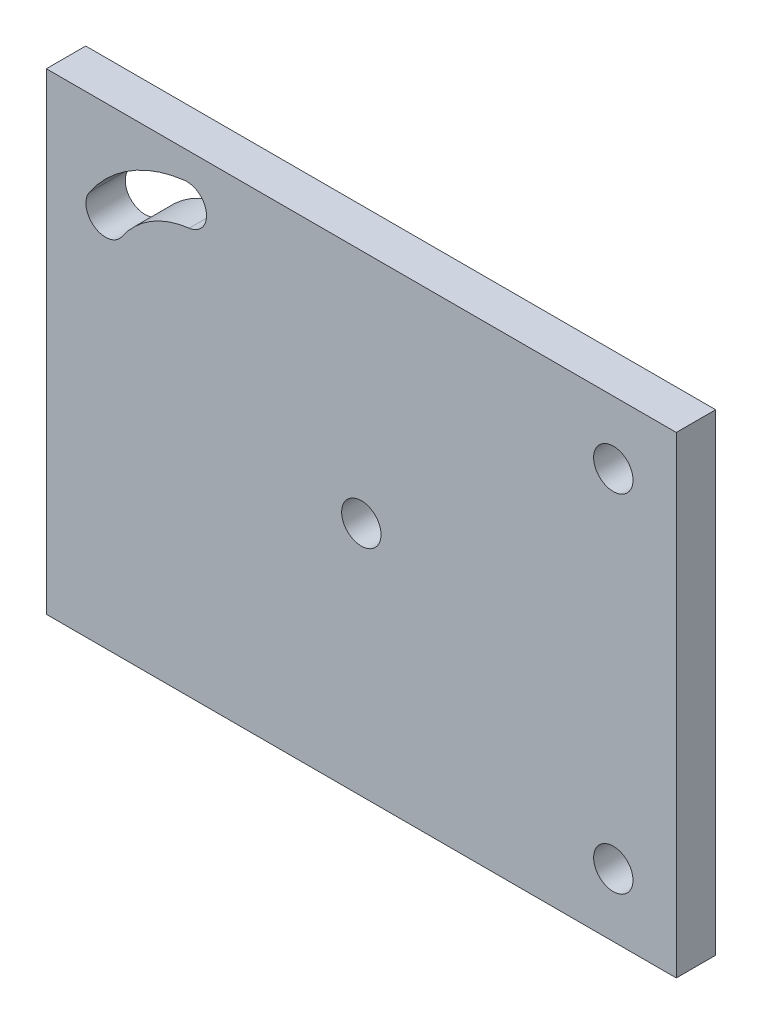
ISO-10303-21;
HEADER;
FILE_DESCRIPTION(('STEP AP214'),'2;1');
FILE_NAME('part.step','',(''),(''),'','','');
FILE_SCHEMA(('AUTOMOTIVE_DESIGN { 1 0 10303 214 1 1 1 1 }'));
ENDSEC;
DATA;
#1=APPLICATION_CONTEXT('core data for automotive mechanical design processes');
#2=APPLICATION_PROTOCOL_DEFINITION('international standard','automotive_design',2000,#1);
#3=PRODUCT_CONTEXT('',#1,'mechanical');
#4=PRODUCT('Part','Part','',(#3));
#5=PRODUCT_RELATED_PRODUCT_CATEGORY('part','',(#4));
#6=PRODUCT_DEFINITION_FORMATION('','',#4);
#7=PRODUCT_DEFINITION_CONTEXT('part definition',#1,'design');
#8=PRODUCT_DEFINITION('design','',#6,#7);
#9=PRODUCT_DEFINITION_SHAPE('','',#8);
#10=(LENGTH_UNIT() NAMED_UNIT(*) SI_UNIT(.MILLI.,.METRE.));
#11=(NAMED_UNIT(*) PLANE_ANGLE_UNIT() SI_UNIT($,.RADIAN.));
#12=(NAMED_UNIT(*) SI_UNIT($,.STERADIAN.) SOLID_ANGLE_UNIT());
#13=UNCERTAINTY_MEASURE_WITH_UNIT(LENGTH_MEASURE(1.E-05),#10,'distance_accuracy_value','');
#14=(GEOMETRIC_REPRESENTATION_CONTEXT(3) GLOBAL_UNCERTAINTY_ASSIGNED_CONTEXT((#13)) GLOBAL_UNIT_ASSIGNED_CONTEXT((#10,
#11,#12)) REPRESENTATION_CONTEXT('',''));
#15=CARTESIAN_POINT('',(0.,0.,0.));
#16=DIRECTION('',(0.,0.,1.));
#17=DIRECTION('',(1.,0.,0.));
#18=AXIS2_PLACEMENT_3D('',#15,#16,#17);
#19=CARTESIAN_POINT('',(0.,0.,5.));
#20=DIRECTION('',(0.,0.,1.));
#21=DIRECTION('',(1.,0.,0.));
#22=AXIS2_PLACEMENT_3D('',#19,#20,#21);
#23=PLANE('',#22);
#24=CARTESIAN_POINT('',(72.,-52.,5.));
#25=DIRECTION('',(0.,0.,1.));
#26=DIRECTION('',(1.,0.,0.));
#27=AXIS2_PLACEMENT_3D('',#24,#25,#26);
#28=CIRCLE('',#27,2.5);
#29=CARTESIAN_POINT('',(74.5,-52.,5.));
#30=VERTEX_POINT('',#29);
#31=EDGE_CURVE('E244',#30,#30,#28,.T.);
#32=ORIENTED_EDGE('',*,*,#31,.F.);
#33=EDGE_LOOP('',(#32));
#34=FACE_BOUND('',#33,.T.);
#35=CARTESIAN_POINT('',(72.,-8.,5.));
#36=DIRECTION('',(0.,0.,1.));
#37=DIRECTION('',(1.,0.,0.));
#38=AXIS2_PLACEMENT_3D('',#35,#36,#37);
#39=CIRCLE('',#38,2.5);
#40=CARTESIAN_POINT('',(74.5,-8.,5.));
#41=VERTEX_POINT('',#40);
#42=EDGE_CURVE('E122',#41,#41,#39,.T.);
#43=ORIENTED_EDGE('',*,*,#42,.F.);
#44=EDGE_LOOP('',(#43));
#45=FACE_BOUND('',#44,.T.);
#46=CARTESIAN_POINT('',(17.8456324907193,-5.9827922517119,5.));
#47=DIRECTION('',(0.,0.,1.));
#48=DIRECTION('',(1.,0.,0.));
#49=AXIS2_PLACEMENT_3D('',#46,#47,#48);
#50=CIRCLE('',#49,2.5);
#51=CARTESIAN_POINT('',(18.1384509239494,-8.4655845034238,5.));
#52=VERTEX_POINT('',#51);
#53=CARTESIAN_POINT('',(17.5528140574892,-3.5,5.));
#54=VERTEX_POINT('',#53);
#55=EDGE_CURVE('E48',#52,#54,#50,.T.);
#56=ORIENTED_EDGE('',*,*,#55,.F.);
#57=CARTESIAN_POINT('',(19.5439794034541,-20.3829873116409,5.));
#58=DIRECTION('',(0.,0.,-1.));
#59=DIRECTION('',(1.,0.,0.));
#60=AXIS2_PLACEMENT_3D('',#57,#58,#59);
#61=CIRCLE('',#60,12.);
#62=CARTESIAN_POINT('',(9.59845967454192,-13.6683289195991,5.));
#63=VERTEX_POINT('',#62);
#64=EDGE_CURVE('E116',#63,#52,#61,.T.);
#65=ORIENTED_EDGE('',*,*,#64,.F.);
#66=CARTESIAN_POINT('',(7.52647639768521,-12.2694417545903,5.));
#67=DIRECTION('',(0.,0.,1.));
#68=DIRECTION('',(1.,0.,0.));
#69=AXIS2_PLACEMENT_3D('',#66,#67,#68);
#70=CIRCLE('',#69,2.5);
#71=CARTESIAN_POINT('',(5.45449312082851,-10.8705545895816,5.));
#72=VERTEX_POINT('',#71);
#73=EDGE_CURVE('E119',#72,#63,#70,.T.);
#74=ORIENTED_EDGE('',*,*,#73,.F.);
#75=CARTESIAN_POINT('',(19.5439794034541,-20.3829873116409,5.));
#76=DIRECTION('',(0.,0.,1.));
#77=DIRECTION('',(1.,0.,0.));
#78=AXIS2_PLACEMENT_3D('',#75,#76,#77);
#79=CIRCLE('',#78,17.);
#80=EDGE_CURVE('E128',#54,#72,#79,.T.);
#81=ORIENTED_EDGE('',*,*,#80,.F.);
#82=EDGE_LOOP('',(#56,#65,#74,#81));
#83=FACE_BOUND('',#82,.T.);
#84=DIRECTION('',(0.,-1.,0.));
#85=VECTOR('',#84,1.);
#86=CARTESIAN_POINT('',(0.,0.,5.));
#87=LINE('',#86,#85);
#88=CARTESIAN_POINT('',(0.,0.,5.));
#89=VERTEX_POINT('',#88);
#90=CARTESIAN_POINT('',(0.,-60.,5.));
#91=VERTEX_POINT('',#90);
#92=EDGE_CURVE('E145',#89,#91,#87,.T.);
#93=ORIENTED_EDGE('',*,*,#92,.T.);
#94=DIRECTION('',(1.,0.,0.));
#95=VECTOR('',#94,1.);
#96=CARTESIAN_POINT('',(0.,-60.,5.));
#97=LINE('',#96,#95);
#98=CARTESIAN_POINT('',(80.,-60.,5.));
#99=VERTEX_POINT('',#98);
#100=EDGE_CURVE('E148',#91,#99,#97,.T.);
#101=ORIENTED_EDGE('',*,*,#100,.T.);
#102=DIRECTION('',(0.,1.,0.));
#103=VECTOR('',#102,1.);
#104=CARTESIAN_POINT('',(80.,0.,5.));
#105=LINE('',#104,#103);
#106=CARTESIAN_POINT('',(80.,0.,5.));
#107=VERTEX_POINT('',#106);
#108=EDGE_CURVE('E151',#99,#107,#105,.T.);
#109=ORIENTED_EDGE('',*,*,#108,.T.);
#110=DIRECTION('',(-1.,0.,0.));
#111=VECTOR('',#110,1.);
#112=CARTESIAN_POINT('',(0.,0.,5.));
#113=LINE('',#112,#111);
#114=EDGE_CURVE('E153',#107,#89,#113,.T.);
#115=ORIENTED_EDGE('',*,*,#114,.T.);
#116=EDGE_LOOP('',(#93,#101,#109,#115));
#117=FACE_BOUND('',#116,.T.);
#118=CARTESIAN_POINT('',(40.,-30.,5.));
#119=DIRECTION('',(0.,0.,1.));
#120=DIRECTION('',(1.,0.,0.));
#121=AXIS2_PLACEMENT_3D('',#118,#119,#120);
#122=CIRCLE('',#121,2.5);
#123=CARTESIAN_POINT('',(42.5,-30.,5.));
#124=VERTEX_POINT('',#123);
#125=EDGE_CURVE('E137',#124,#124,#122,.T.);
#126=ORIENTED_EDGE('',*,*,#125,.F.);
#127=EDGE_LOOP('',(#126));
#128=FACE_BOUND('',#127,.T.);
#129=ADVANCED_FACE('F33',(#34,#45,#83,#117,#128),#23,.T.);
#130=CARTESIAN_POINT('',(0.,0.,0.));
#131=DIRECTION('',(0.,0.,1.));
#132=DIRECTION('',(1.,0.,0.));
#133=AXIS2_PLACEMENT_3D('',#130,#131,#132);
#134=PLANE('',#133);
#135=CARTESIAN_POINT('',(72.,-52.,0.));
#136=DIRECTION('',(0.,0.,1.));
#137=DIRECTION('',(1.,0.,0.));
#138=AXIS2_PLACEMENT_3D('',#135,#136,#137);
#139=CIRCLE('',#138,2.5);
#140=CARTESIAN_POINT('',(74.5,-52.,0.));
#141=VERTEX_POINT('',#140);
#142=EDGE_CURVE('E144',#141,#141,#139,.T.);
#143=ORIENTED_EDGE('',*,*,#142,.T.);
#144=EDGE_LOOP('',(#143));
#145=FACE_BOUND('',#144,.T.);
#146=CARTESIAN_POINT('',(72.,-8.,0.));
#147=DIRECTION('',(0.,0.,1.));
#148=DIRECTION('',(1.,0.,0.));
#149=AXIS2_PLACEMENT_3D('',#146,#147,#148);
#150=CIRCLE('',#149,2.5);
#151=CARTESIAN_POINT('',(74.5,-8.,0.));
#152=VERTEX_POINT('',#151);
#153=EDGE_CURVE('E245',#152,#152,#150,.T.);
#154=ORIENTED_EDGE('',*,*,#153,.T.);
#155=EDGE_LOOP('',(#154));
#156=FACE_BOUND('',#155,.T.);
#157=CARTESIAN_POINT('',(19.5439794034541,-20.3829873116409,0.));
#158=DIRECTION('',(0.,0.,-1.));
#159=DIRECTION('',(1.,0.,0.));
#160=AXIS2_PLACEMENT_3D('',#157,#158,#159);
#161=CIRCLE('',#160,12.);
#162=CARTESIAN_POINT('',(9.59845967454192,-13.6683289195991,0.));
#163=VERTEX_POINT('',#162);
#164=CARTESIAN_POINT('',(18.1384509239494,-8.4655845034238,0.));
#165=VERTEX_POINT('',#164);
#166=EDGE_CURVE('E106',#163,#165,#161,.T.);
#167=ORIENTED_EDGE('',*,*,#166,.T.);
#168=CARTESIAN_POINT('',(17.8456324907193,-5.9827922517119,0.));
#169=DIRECTION('',(0.,0.,1.));
#170=DIRECTION('',(1.,0.,0.));
#171=AXIS2_PLACEMENT_3D('',#168,#169,#170);
#172=CIRCLE('',#171,2.5);
#173=CARTESIAN_POINT('',(17.5528140574892,-3.5,0.));
#174=VERTEX_POINT('',#173);
#175=EDGE_CURVE('E100',#165,#174,#172,.T.);
#176=ORIENTED_EDGE('',*,*,#175,.T.);
#177=CARTESIAN_POINT('',(19.5439794034541,-20.3829873116409,0.));
#178=DIRECTION('',(0.,0.,1.));
#179=DIRECTION('',(1.,0.,0.));
#180=AXIS2_PLACEMENT_3D('',#177,#178,#179);
#181=CIRCLE('',#180,17.);
#182=CARTESIAN_POINT('',(5.45449312082851,-10.8705545895816,0.));
#183=VERTEX_POINT('',#182);
#184=EDGE_CURVE('E109',#174,#183,#181,.T.);
#185=ORIENTED_EDGE('',*,*,#184,.T.);
#186=CARTESIAN_POINT('',(7.52647639768521,-12.2694417545903,0.));
#187=DIRECTION('',(0.,0.,1.));
#188=DIRECTION('',(1.,0.,0.));
#189=AXIS2_PLACEMENT_3D('',#186,#187,#188);
#190=CIRCLE('',#189,2.5);
#191=EDGE_CURVE('E56',#183,#163,#190,.T.);
#192=ORIENTED_EDGE('',*,*,#191,.T.);
#193=EDGE_LOOP('',(#167,#176,#185,#192));
#194=FACE_BOUND('',#193,.T.);
#195=DIRECTION('',(0.,-1.,0.));
#196=VECTOR('',#195,1.);
#197=CARTESIAN_POINT('',(0.,0.,0.));
#198=LINE('',#197,#196);
#199=CARTESIAN_POINT('',(0.,0.,0.));
#200=VERTEX_POINT('',#199);
#201=CARTESIAN_POINT('',(0.,-60.,0.));
#202=VERTEX_POINT('',#201);
#203=EDGE_CURVE('E140',#200,#202,#198,.T.);
#204=ORIENTED_EDGE('',*,*,#203,.F.);
#205=DIRECTION('',(-1.,0.,0.));
#206=VECTOR('',#205,1.);
#207=CARTESIAN_POINT('',(0.,0.,0.));
#208=LINE('',#207,#206);
#209=CARTESIAN_POINT('',(80.,0.,0.));
#210=VERTEX_POINT('',#209);
#211=EDGE_CURVE('E149',#210,#200,#208,.T.);
#212=ORIENTED_EDGE('',*,*,#211,.F.);
#213=DIRECTION('',(0.,1.,0.));
#214=VECTOR('',#213,1.);
#215=CARTESIAN_POINT('',(80.,0.,0.));
#216=LINE('',#215,#214);
#217=CARTESIAN_POINT('',(80.,-60.,0.));
#218=VERTEX_POINT('',#217);
#219=EDGE_CURVE('E160',#218,#210,#216,.T.);
#220=ORIENTED_EDGE('',*,*,#219,.F.);
#221=DIRECTION('',(1.,0.,0.));
#222=VECTOR('',#221,1.);
#223=CARTESIAN_POINT('',(0.,-60.,0.));
#224=LINE('',#223,#222);
#225=EDGE_CURVE('E158',#202,#218,#224,.T.);
#226=ORIENTED_EDGE('',*,*,#225,.F.);
#227=EDGE_LOOP('',(#204,#212,#220,#226));
#228=FACE_BOUND('',#227,.T.);
#229=CARTESIAN_POINT('',(40.,-30.,0.));
#230=DIRECTION('',(0.,0.,1.));
#231=DIRECTION('',(1.,0.,0.));
#232=AXIS2_PLACEMENT_3D('',#229,#230,#231);
#233=CIRCLE('',#232,2.5);
#234=CARTESIAN_POINT('',(42.5,-30.,0.));
#235=VERTEX_POINT('',#234);
#236=EDGE_CURVE('E141',#235,#235,#233,.T.);
#237=ORIENTED_EDGE('',*,*,#236,.T.);
#238=EDGE_LOOP('',(#237));
#239=FACE_BOUND('',#238,.T.);
#240=ADVANCED_FACE('F113',(#145,#156,#194,#228,#239),#134,.F.);
#241=CARTESIAN_POINT('',(0.,0.,5.));
#242=DIRECTION('',(1.,0.,0.));
#243=DIRECTION('',(0.,1.,0.));
#244=AXIS2_PLACEMENT_3D('',#241,#242,#243);
#245=PLANE('',#244);
#246=ORIENTED_EDGE('',*,*,#203,.T.);
#247=DIRECTION('',(0.,0.,-1.));
#248=VECTOR('',#247,1.);
#249=CARTESIAN_POINT('',(0.,-60.,5.));
#250=LINE('',#249,#248);
#251=EDGE_CURVE('E11',#91,#202,#250,.T.);
#252=ORIENTED_EDGE('',*,*,#251,.F.);
#253=ORIENTED_EDGE('',*,*,#92,.F.);
#254=DIRECTION('',(0.,0.,-1.));
#255=VECTOR('',#254,1.);
#256=CARTESIAN_POINT('',(0.,0.,5.));
#257=LINE('',#256,#255);
#258=EDGE_CURVE('E155',#89,#200,#257,.T.);
#259=ORIENTED_EDGE('',*,*,#258,.T.);
#260=EDGE_LOOP('',(#246,#252,#253,#259));
#261=FACE_BOUND('',#260,.T.);
#262=ADVANCED_FACE('F35',(#261),#245,.F.);
#263=CARTESIAN_POINT('',(0.,-60.,5.));
#264=DIRECTION('',(0.,1.,0.));
#265=DIRECTION('',(0.,0.,1.));
#266=AXIS2_PLACEMENT_3D('',#263,#264,#265);
#267=PLANE('',#266);
#268=ORIENTED_EDGE('',*,*,#225,.T.);
#269=DIRECTION('',(0.,0.,-1.));
#270=VECTOR('',#269,1.);
#271=CARTESIAN_POINT('',(80.,-60.,5.));
#272=LINE('',#271,#270);
#273=EDGE_CURVE('E41',#99,#218,#272,.T.);
#274=ORIENTED_EDGE('',*,*,#273,.F.);
#275=ORIENTED_EDGE('',*,*,#100,.F.);
#276=ORIENTED_EDGE('',*,*,#251,.T.);
#277=EDGE_LOOP('',(#268,#274,#275,#276));
#278=FACE_BOUND('',#277,.T.);
#279=ADVANCED_FACE('F187',(#278),#267,.F.);
#280=CARTESIAN_POINT('',(80.,0.,5.));
#281=DIRECTION('',(-1.,0.,0.));
#282=DIRECTION('',(0.,-1.,0.));
#283=AXIS2_PLACEMENT_3D('',#280,#281,#282);
#284=PLANE('',#283);
#285=ORIENTED_EDGE('',*,*,#219,.T.);
#286=DIRECTION('',(0.,0.,-1.));
#287=VECTOR('',#286,1.);
#288=CARTESIAN_POINT('',(80.,0.,5.));
#289=LINE('',#288,#287);
#290=EDGE_CURVE('E165',#107,#210,#289,.T.);
#291=ORIENTED_EDGE('',*,*,#290,.F.);
#292=ORIENTED_EDGE('',*,*,#108,.F.);
#293=ORIENTED_EDGE('',*,*,#273,.T.);
#294=EDGE_LOOP('',(#285,#291,#292,#293));
#295=FACE_BOUND('',#294,.T.);
#296=ADVANCED_FACE('F172',(#295),#284,.F.);
#297=CARTESIAN_POINT('',(0.,0.,5.));
#298=DIRECTION('',(0.,-1.,0.));
#299=DIRECTION('',(0.,0.,-1.));
#300=AXIS2_PLACEMENT_3D('',#297,#298,#299);
#301=PLANE('',#300);
#302=ORIENTED_EDGE('',*,*,#211,.T.);
#303=ORIENTED_EDGE('',*,*,#258,.F.);
#304=ORIENTED_EDGE('',*,*,#114,.F.);
#305=ORIENTED_EDGE('',*,*,#290,.T.);
#306=EDGE_LOOP('',(#302,#303,#304,#305));
#307=FACE_BOUND('',#306,.T.);
#308=ADVANCED_FACE('F180',(#307),#301,.F.);
#309=CARTESIAN_POINT('',(40.,-30.,5.));
#310=DIRECTION('',(0.,0.,-1.));
#311=DIRECTION('',(-1.,0.,0.));
#312=AXIS2_PLACEMENT_3D('',#309,#310,#311);
#313=CYLINDRICAL_SURFACE('',#312,2.5);
#314=ORIENTED_EDGE('',*,*,#125,.T.);
#315=EDGE_LOOP('',(#314));
#316=FACE_BOUND('',#315,.T.);
#317=ORIENTED_EDGE('',*,*,#236,.F.);
#318=EDGE_LOOP('',(#317));
#319=FACE_BOUND('',#318,.T.);
#320=ADVANCED_FACE('F205',(#316,#319),#313,.F.);
#321=CARTESIAN_POINT('',(17.8456324907193,-5.9827922517119,0.));
#322=DIRECTION('',(0.,0.,1.));
#323=DIRECTION('',(1.,0.,0.));
#324=AXIS2_PLACEMENT_3D('',#321,#322,#323);
#325=CYLINDRICAL_SURFACE('',#324,2.5);
#326=ORIENTED_EDGE('',*,*,#55,.T.);
#327=DIRECTION('',(0.,0.,1.));
#328=VECTOR('',#327,1.);
#329=CARTESIAN_POINT('',(17.5528140574892,-3.5,0.));
#330=LINE('',#329,#328);
#331=EDGE_CURVE('E96',#174,#54,#330,.T.);
#332=ORIENTED_EDGE('',*,*,#331,.F.);
#333=ORIENTED_EDGE('',*,*,#175,.F.);
#334=DIRECTION('',(0.,0.,1.));
#335=VECTOR('',#334,1.);
#336=CARTESIAN_POINT('',(18.1384509239494,-8.4655845034238,0.));
#337=LINE('',#336,#335);
#338=EDGE_CURVE('E132',#165,#52,#337,.T.);
#339=ORIENTED_EDGE('',*,*,#338,.T.);
#340=EDGE_LOOP('',(#326,#332,#333,#339));
#341=FACE_BOUND('',#340,.T.);
#342=ADVANCED_FACE('F98',(#341),#325,.F.);
#343=CARTESIAN_POINT('',(19.5439794034541,-20.3829873116409,0.));
#344=DIRECTION('',(0.,0.,1.));
#345=DIRECTION('',(1.,0.,0.));
#346=AXIS2_PLACEMENT_3D('',#343,#344,#345);
#347=CYLINDRICAL_SURFACE('',#346,12.);
#348=ORIENTED_EDGE('',*,*,#64,.T.);
#349=ORIENTED_EDGE('',*,*,#338,.F.);
#350=ORIENTED_EDGE('',*,*,#166,.F.);
#351=DIRECTION('',(0.,0.,1.));
#352=VECTOR('',#351,1.);
#353=CARTESIAN_POINT('',(9.59845967454192,-13.6683289195991,0.));
#354=LINE('',#353,#352);
#355=EDGE_CURVE('E134',#163,#63,#354,.T.);
#356=ORIENTED_EDGE('',*,*,#355,.T.);
#357=EDGE_LOOP('',(#348,#349,#350,#356));
#358=FACE_BOUND('',#357,.T.);
#359=ADVANCED_FACE('F216',(#358),#347,.T.);
#360=CARTESIAN_POINT('',(7.52647639768521,-12.2694417545903,0.));
#361=DIRECTION('',(0.,0.,1.));
#362=DIRECTION('',(1.,0.,0.));
#363=AXIS2_PLACEMENT_3D('',#360,#361,#362);
#364=CYLINDRICAL_SURFACE('',#363,2.5);
#365=ORIENTED_EDGE('',*,*,#73,.T.);
#366=ORIENTED_EDGE('',*,*,#355,.F.);
#367=ORIENTED_EDGE('',*,*,#191,.F.);
#368=DIRECTION('',(0.,0.,1.));
#369=VECTOR('',#368,1.);
#370=CARTESIAN_POINT('',(5.45449312082851,-10.8705545895816,0.));
#371=LINE('',#370,#369);
#372=EDGE_CURVE('E105',#183,#72,#371,.T.);
#373=ORIENTED_EDGE('',*,*,#372,.T.);
#374=EDGE_LOOP('',(#365,#366,#367,#373));
#375=FACE_BOUND('',#374,.T.);
#376=ADVANCED_FACE('F223',(#375),#364,.F.);
#377=CARTESIAN_POINT('',(19.5439794034541,-20.3829873116409,0.));
#378=DIRECTION('',(0.,0.,1.));
#379=DIRECTION('',(1.,0.,0.));
#380=AXIS2_PLACEMENT_3D('',#377,#378,#379);
#381=CYLINDRICAL_SURFACE('',#380,17.);
#382=ORIENTED_EDGE('',*,*,#80,.T.);
#383=ORIENTED_EDGE('',*,*,#372,.F.);
#384=ORIENTED_EDGE('',*,*,#184,.F.);
#385=ORIENTED_EDGE('',*,*,#331,.T.);
#386=EDGE_LOOP('',(#382,#383,#384,#385));
#387=FACE_BOUND('',#386,.T.);
#388=ADVANCED_FACE('F110',(#387),#381,.F.);
#389=CARTESIAN_POINT('',(72.,-8.,0.));
#390=DIRECTION('',(0.,0.,1.));
#391=DIRECTION('',(1.,0.,0.));
#392=AXIS2_PLACEMENT_3D('',#389,#390,#391);
#393=CYLINDRICAL_SURFACE('',#392,2.5);
#394=ORIENTED_EDGE('',*,*,#153,.F.);
#395=EDGE_LOOP('',(#394));
#396=FACE_BOUND('',#395,.T.);
#397=ORIENTED_EDGE('',*,*,#42,.T.);
#398=EDGE_LOOP('',(#397));
#399=FACE_BOUND('',#398,.T.);
#400=ADVANCED_FACE('F229',(#396,#399),#393,.F.);
#401=CARTESIAN_POINT('',(72.,-52.,0.));
#402=DIRECTION('',(0.,0.,1.));
#403=DIRECTION('',(1.,0.,0.));
#404=AXIS2_PLACEMENT_3D('',#401,#402,#403);
#405=CYLINDRICAL_SURFACE('',#404,2.5);
#406=ORIENTED_EDGE('',*,*,#142,.F.);
#407=EDGE_LOOP('',(#406));
#408=FACE_BOUND('',#407,.T.);
#409=ORIENTED_EDGE('',*,*,#31,.T.);
#410=EDGE_LOOP('',(#409));
#411=FACE_BOUND('',#410,.T.);
#412=ADVANCED_FACE('F234',(#408,#411),#405,.F.);
#413=CLOSED_SHELL('',(#129,#240,#262,#279,#296,#308,#320,#342,#359,#376,#388,#400,#412));
#414=MANIFOLD_SOLID_BREP('B2',#413);
#415=ADVANCED_BREP_SHAPE_REPRESENTATION('',(#18,#414),#14);
#416=SHAPE_DEFINITION_REPRESENTATION(#9,#415);
ENDSEC;
END-ISO-10303-21;
